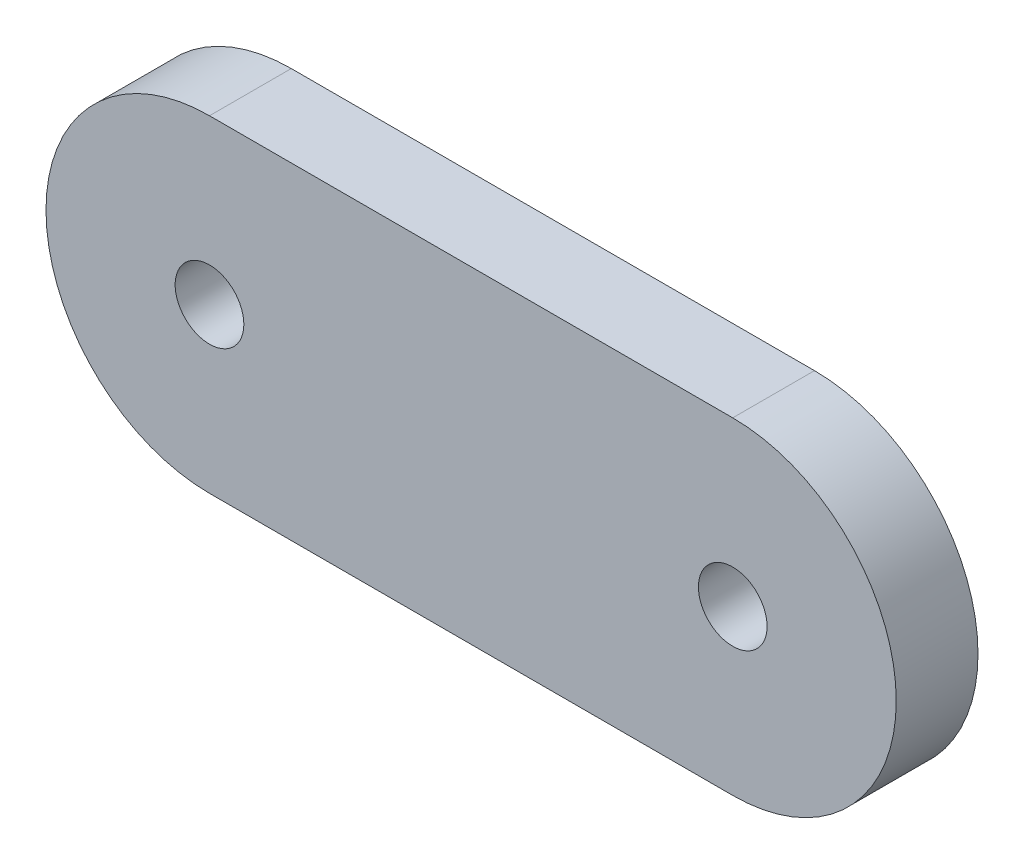
ISO-10303-21;
HEADER;
FILE_DESCRIPTION(('STEP AP214'),'2;1');
FILE_NAME('part.step','',(''),(''),'','','');
FILE_SCHEMA(('AUTOMOTIVE_DESIGN { 1 0 10303 214 1 1 1 1 }'));
ENDSEC;
DATA;
#1=APPLICATION_CONTEXT('core data for automotive mechanical design processes');
#2=APPLICATION_PROTOCOL_DEFINITION('international standard','automotive_design',2000,#1);
#3=PRODUCT_CONTEXT('',#1,'mechanical');
#4=PRODUCT('Part','Part','',(#3));
#5=PRODUCT_RELATED_PRODUCT_CATEGORY('part','',(#4));
#6=PRODUCT_DEFINITION_FORMATION('','',#4);
#7=PRODUCT_DEFINITION_CONTEXT('part definition',#1,'design');
#8=PRODUCT_DEFINITION('design','',#6,#7);
#9=PRODUCT_DEFINITION_SHAPE('','',#8);
#10=(LENGTH_UNIT() NAMED_UNIT(*) SI_UNIT(.MILLI.,.METRE.));
#11=(NAMED_UNIT(*) PLANE_ANGLE_UNIT() SI_UNIT($,.RADIAN.));
#12=(NAMED_UNIT(*) SI_UNIT($,.STERADIAN.) SOLID_ANGLE_UNIT());
#13=UNCERTAINTY_MEASURE_WITH_UNIT(LENGTH_MEASURE(1.E-05),#10,'distance_accuracy_value','');
#14=(GEOMETRIC_REPRESENTATION_CONTEXT(3) GLOBAL_UNCERTAINTY_ASSIGNED_CONTEXT((#13)) GLOBAL_UNIT_ASSIGNED_CONTEXT((#10,
#11,#12)) REPRESENTATION_CONTEXT('',''));
#15=CARTESIAN_POINT('',(0.,0.,0.));
#16=DIRECTION('',(0.,0.,1.));
#17=DIRECTION('',(1.,0.,0.));
#18=AXIS2_PLACEMENT_3D('',#15,#16,#17);
#19=CARTESIAN_POINT('',(-43.715181521775,0.,5.));
#20=DIRECTION('',(0.,0.,1.));
#21=DIRECTION('',(1.,0.,0.));
#22=AXIS2_PLACEMENT_3D('',#19,#20,#21);
#23=PLANE('',#22);
#24=CARTESIAN_POINT('',(-43.715181521775,0.,5.));
#25=DIRECTION('',(0.,0.,1.));
#26=DIRECTION('',(1.,0.,0.));
#27=AXIS2_PLACEMENT_3D('',#24,#25,#26);
#28=CIRCLE('',#27,2.1);
#29=CARTESIAN_POINT('',(-41.615181521775,0.,5.));
#30=VERTEX_POINT('',#29);
#31=EDGE_CURVE('E100',#30,#30,#28,.T.);
#32=ORIENTED_EDGE('',*,*,#31,.F.);
#33=EDGE_LOOP('',(#32));
#34=FACE_BOUND('',#33,.T.);
#35=CARTESIAN_POINT('',(-43.715181521775,0.,5.));
#36=DIRECTION('',(0.,0.,1.));
#37=DIRECTION('',(1.,0.,0.));
#38=AXIS2_PLACEMENT_3D('',#35,#36,#37);
#39=CIRCLE('',#38,10.);
#40=CARTESIAN_POINT('',(-43.715181521775,10.,5.));
#41=VERTEX_POINT('',#40);
#42=CARTESIAN_POINT('',(-43.715181521775,-10.,5.));
#43=VERTEX_POINT('',#42);
#44=EDGE_CURVE('E85',#41,#43,#39,.T.);
#45=ORIENTED_EDGE('',*,*,#44,.T.);
#46=DIRECTION('',(1.,0.,0.));
#47=VECTOR('',#46,1.);
#48=CARTESIAN_POINT('',(-43.715181521775,-10.,5.));
#49=LINE('',#48,#47);
#50=CARTESIAN_POINT('',(-11.7151815217749,-10.,5.));
#51=VERTEX_POINT('',#50);
#52=EDGE_CURVE('E80',#43,#51,#49,.T.);
#53=ORIENTED_EDGE('',*,*,#52,.T.);
#54=CARTESIAN_POINT('',(-11.7151815217749,0.,5.));
#55=DIRECTION('',(0.,0.,1.));
#56=DIRECTION('',(1.,0.,0.));
#57=AXIS2_PLACEMENT_3D('',#54,#55,#56);
#58=CIRCLE('',#57,10.);
#59=CARTESIAN_POINT('',(-11.7151815217749,10.,5.));
#60=VERTEX_POINT('',#59);
#61=EDGE_CURVE('E83',#51,#60,#58,.T.);
#62=ORIENTED_EDGE('',*,*,#61,.T.);
#63=DIRECTION('',(-1.,0.,0.));
#64=VECTOR('',#63,1.);
#65=CARTESIAN_POINT('',(-43.715181521775,10.,5.));
#66=LINE('',#65,#64);
#67=EDGE_CURVE('E50',#60,#41,#66,.T.);
#68=ORIENTED_EDGE('',*,*,#67,.T.);
#69=EDGE_LOOP('',(#45,#53,#62,#68));
#70=FACE_BOUND('',#69,.T.);
#71=CARTESIAN_POINT('',(-11.7151815217749,0.,5.));
#72=DIRECTION('',(0.,0.,1.));
#73=DIRECTION('',(1.,0.,0.));
#74=AXIS2_PLACEMENT_3D('',#71,#72,#73);
#75=CIRCLE('',#74,2.1);
#76=CARTESIAN_POINT('',(-9.61518152177495,0.,5.));
#77=VERTEX_POINT('',#76);
#78=EDGE_CURVE('E115',#77,#77,#75,.T.);
#79=ORIENTED_EDGE('',*,*,#78,.F.);
#80=EDGE_LOOP('',(#79));
#81=FACE_BOUND('',#80,.T.);
#82=ADVANCED_FACE('F33',(#34,#70,#81),#23,.T.);
#83=CARTESIAN_POINT('',(-43.715181521775,0.,0.));
#84=DIRECTION('',(0.,0.,1.));
#85=DIRECTION('',(1.,0.,0.));
#86=AXIS2_PLACEMENT_3D('',#83,#84,#85);
#87=PLANE('',#86);
#88=CARTESIAN_POINT('',(-43.715181521775,0.,0.));
#89=DIRECTION('',(0.,0.,1.));
#90=DIRECTION('',(1.,0.,0.));
#91=AXIS2_PLACEMENT_3D('',#88,#89,#90);
#92=CIRCLE('',#91,2.1);
#93=CARTESIAN_POINT('',(-41.615181521775,0.,0.));
#94=VERTEX_POINT('',#93);
#95=EDGE_CURVE('E112',#94,#94,#92,.T.);
#96=ORIENTED_EDGE('',*,*,#95,.T.);
#97=EDGE_LOOP('',(#96));
#98=FACE_BOUND('',#97,.T.);
#99=CARTESIAN_POINT('',(-43.715181521775,0.,0.));
#100=DIRECTION('',(0.,0.,1.));
#101=DIRECTION('',(1.,0.,0.));
#102=AXIS2_PLACEMENT_3D('',#99,#100,#101);
#103=CIRCLE('',#102,10.);
#104=CARTESIAN_POINT('',(-43.715181521775,10.,0.));
#105=VERTEX_POINT('',#104);
#106=CARTESIAN_POINT('',(-43.715181521775,-10.,0.));
#107=VERTEX_POINT('',#106);
#108=EDGE_CURVE('E97',#105,#107,#103,.T.);
#109=ORIENTED_EDGE('',*,*,#108,.F.);
#110=DIRECTION('',(-1.,0.,0.));
#111=VECTOR('',#110,1.);
#112=CARTESIAN_POINT('',(-43.715181521775,10.,0.));
#113=LINE('',#112,#111);
#114=CARTESIAN_POINT('',(-11.7151815217749,10.,0.));
#115=VERTEX_POINT('',#114);
#116=EDGE_CURVE('E73',#115,#105,#113,.T.);
#117=ORIENTED_EDGE('',*,*,#116,.F.);
#118=CARTESIAN_POINT('',(-11.7151815217749,0.,0.));
#119=DIRECTION('',(0.,0.,1.));
#120=DIRECTION('',(1.,0.,0.));
#121=AXIS2_PLACEMENT_3D('',#118,#119,#120);
#122=CIRCLE('',#121,10.);
#123=CARTESIAN_POINT('',(-11.7151815217749,-10.,0.));
#124=VERTEX_POINT('',#123);
#125=EDGE_CURVE('E67',#124,#115,#122,.T.);
#126=ORIENTED_EDGE('',*,*,#125,.F.);
#127=DIRECTION('',(1.,0.,0.));
#128=VECTOR('',#127,1.);
#129=CARTESIAN_POINT('',(-43.715181521775,-10.,0.));
#130=LINE('',#129,#128);
#131=EDGE_CURVE('E89',#107,#124,#130,.T.);
#132=ORIENTED_EDGE('',*,*,#131,.F.);
#133=EDGE_LOOP('',(#109,#117,#126,#132));
#134=FACE_BOUND('',#133,.T.);
#135=CARTESIAN_POINT('',(-11.7151815217749,0.,0.));
#136=DIRECTION('',(0.,0.,1.));
#137=DIRECTION('',(1.,0.,0.));
#138=AXIS2_PLACEMENT_3D('',#135,#136,#137);
#139=CIRCLE('',#138,2.1);
#140=CARTESIAN_POINT('',(-9.61518152177495,0.,0.));
#141=VERTEX_POINT('',#140);
#142=EDGE_CURVE('E118',#141,#141,#139,.T.);
#143=ORIENTED_EDGE('',*,*,#142,.T.);
#144=EDGE_LOOP('',(#143));
#145=FACE_BOUND('',#144,.T.);
#146=ADVANCED_FACE('F108',(#98,#134,#145),#87,.F.);
#147=CARTESIAN_POINT('',(-43.715181521775,0.,5.));
#148=DIRECTION('',(0.,0.,-1.));
#149=DIRECTION('',(-1.,0.,0.));
#150=AXIS2_PLACEMENT_3D('',#147,#148,#149);
#151=CYLINDRICAL_SURFACE('',#150,10.);
#152=ORIENTED_EDGE('',*,*,#108,.T.);
#153=DIRECTION('',(0.,0.,-1.));
#154=VECTOR('',#153,1.);
#155=CARTESIAN_POINT('',(-43.715181521775,-10.,5.));
#156=LINE('',#155,#154);
#157=EDGE_CURVE('E11',#43,#107,#156,.T.);
#158=ORIENTED_EDGE('',*,*,#157,.F.);
#159=ORIENTED_EDGE('',*,*,#44,.F.);
#160=DIRECTION('',(0.,0.,-1.));
#161=VECTOR('',#160,1.);
#162=CARTESIAN_POINT('',(-43.715181521775,10.,5.));
#163=LINE('',#162,#161);
#164=EDGE_CURVE('E93',#41,#105,#163,.T.);
#165=ORIENTED_EDGE('',*,*,#164,.T.);
#166=EDGE_LOOP('',(#152,#158,#159,#165));
#167=FACE_BOUND('',#166,.T.);
#168=ADVANCED_FACE('F35',(#167),#151,.T.);
#169=CARTESIAN_POINT('',(-43.715181521775,-10.,5.));
#170=DIRECTION('',(0.,1.,0.));
#171=DIRECTION('',(0.,0.,1.));
#172=AXIS2_PLACEMENT_3D('',#169,#170,#171);
#173=PLANE('',#172);
#174=ORIENTED_EDGE('',*,*,#131,.T.);
#175=DIRECTION('',(0.,0.,-1.));
#176=VECTOR('',#175,1.);
#177=CARTESIAN_POINT('',(-11.7151815217749,-10.,5.));
#178=LINE('',#177,#176);
#179=EDGE_CURVE('E42',#51,#124,#178,.T.);
#180=ORIENTED_EDGE('',*,*,#179,.F.);
#181=ORIENTED_EDGE('',*,*,#52,.F.);
#182=ORIENTED_EDGE('',*,*,#157,.T.);
#183=EDGE_LOOP('',(#174,#180,#181,#182));
#184=FACE_BOUND('',#183,.T.);
#185=ADVANCED_FACE('F88',(#184),#173,.F.);
#186=CARTESIAN_POINT('',(-11.7151815217749,0.,5.));
#187=DIRECTION('',(0.,0.,-1.));
#188=DIRECTION('',(-1.,0.,0.));
#189=AXIS2_PLACEMENT_3D('',#186,#187,#188);
#190=CYLINDRICAL_SURFACE('',#189,10.);
#191=ORIENTED_EDGE('',*,*,#125,.T.);
#192=DIRECTION('',(0.,0.,-1.));
#193=VECTOR('',#192,1.);
#194=CARTESIAN_POINT('',(-11.7151815217749,10.,5.));
#195=LINE('',#194,#193);
#196=EDGE_CURVE('E90',#60,#115,#195,.T.);
#197=ORIENTED_EDGE('',*,*,#196,.F.);
#198=ORIENTED_EDGE('',*,*,#61,.F.);
#199=ORIENTED_EDGE('',*,*,#179,.T.);
#200=EDGE_LOOP('',(#191,#197,#198,#199));
#201=FACE_BOUND('',#200,.T.);
#202=ADVANCED_FACE('F91',(#201),#190,.T.);
#203=CARTESIAN_POINT('',(-43.715181521775,10.,5.));
#204=DIRECTION('',(0.,-1.,0.));
#205=DIRECTION('',(0.,0.,-1.));
#206=AXIS2_PLACEMENT_3D('',#203,#204,#205);
#207=PLANE('',#206);
#208=ORIENTED_EDGE('',*,*,#116,.T.);
#209=ORIENTED_EDGE('',*,*,#164,.F.);
#210=ORIENTED_EDGE('',*,*,#67,.F.);
#211=ORIENTED_EDGE('',*,*,#196,.T.);
#212=EDGE_LOOP('',(#208,#209,#210,#211));
#213=FACE_BOUND('',#212,.T.);
#214=ADVANCED_FACE('F105',(#213),#207,.F.);
#215=CARTESIAN_POINT('',(-43.715181521775,0.,5.));
#216=DIRECTION('',(0.,0.,-1.));
#217=DIRECTION('',(-1.,0.,0.));
#218=AXIS2_PLACEMENT_3D('',#215,#216,#217);
#219=CYLINDRICAL_SURFACE('',#218,2.1);
#220=ORIENTED_EDGE('',*,*,#31,.T.);
#221=EDGE_LOOP('',(#220));
#222=FACE_BOUND('',#221,.T.);
#223=ORIENTED_EDGE('',*,*,#95,.F.);
#224=EDGE_LOOP('',(#223));
#225=FACE_BOUND('',#224,.T.);
#226=ADVANCED_FACE('F136',(#222,#225),#219,.F.);
#227=CARTESIAN_POINT('',(-11.7151815217749,0.,5.));
#228=DIRECTION('',(0.,0.,-1.));
#229=DIRECTION('',(-1.,0.,0.));
#230=AXIS2_PLACEMENT_3D('',#227,#228,#229);
#231=CYLINDRICAL_SURFACE('',#230,2.1);
#232=ORIENTED_EDGE('',*,*,#78,.T.);
#233=EDGE_LOOP('',(#232));
#234=FACE_BOUND('',#233,.T.);
#235=ORIENTED_EDGE('',*,*,#142,.F.);
#236=EDGE_LOOP('',(#235));
#237=FACE_BOUND('',#236,.T.);
#238=ADVANCED_FACE('F124',(#234,#237),#231,.F.);
#239=CLOSED_SHELL('',(#82,#146,#168,#185,#202,#214,#226,#238));
#240=MANIFOLD_SOLID_BREP('B2',#239);
#241=ADVANCED_BREP_SHAPE_REPRESENTATION('',(#18,#240),#14);
#242=SHAPE_DEFINITION_REPRESENTATION(#9,#241);
ENDSEC;
END-ISO-10303-21;
